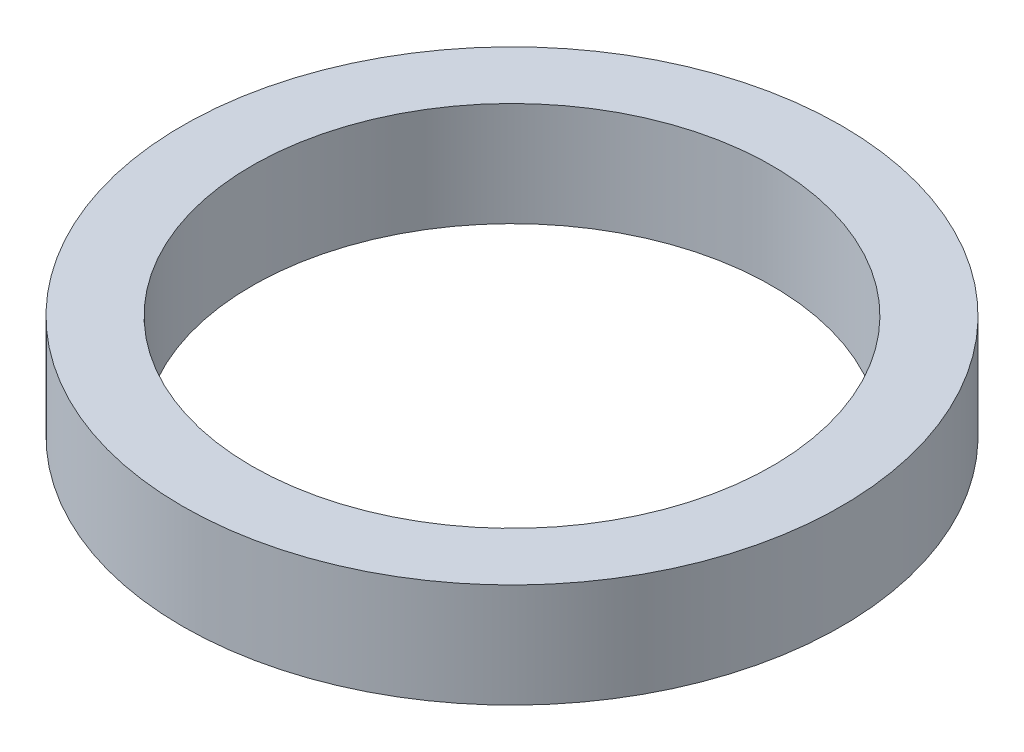
ISO-10303-21;
HEADER;
FILE_DESCRIPTION(('STEP AP214'),'2;1');
FILE_NAME('part.step','',(''),(''),'','','');
FILE_SCHEMA(('AUTOMOTIVE_DESIGN { 1 0 10303 214 1 1 1 1 }'));
ENDSEC;
DATA;
#1=APPLICATION_CONTEXT('core data for automotive mechanical design processes');
#2=APPLICATION_PROTOCOL_DEFINITION('international standard','automotive_design',2000,#1);
#3=PRODUCT_CONTEXT('',#1,'mechanical');
#4=PRODUCT('Part','Part','',(#3));
#5=PRODUCT_RELATED_PRODUCT_CATEGORY('part','',(#4));
#6=PRODUCT_DEFINITION_FORMATION('','',#4);
#7=PRODUCT_DEFINITION_CONTEXT('part definition',#1,'design');
#8=PRODUCT_DEFINITION('design','',#6,#7);
#9=PRODUCT_DEFINITION_SHAPE('','',#8);
#10=(LENGTH_UNIT() NAMED_UNIT(*) SI_UNIT(.MILLI.,.METRE.));
#11=(NAMED_UNIT(*) PLANE_ANGLE_UNIT() SI_UNIT($,.RADIAN.));
#12=(NAMED_UNIT(*) SI_UNIT($,.STERADIAN.) SOLID_ANGLE_UNIT());
#13=UNCERTAINTY_MEASURE_WITH_UNIT(LENGTH_MEASURE(1.E-05),#10,'distance_accuracy_value','');
#14=(GEOMETRIC_REPRESENTATION_CONTEXT(3) GLOBAL_UNCERTAINTY_ASSIGNED_CONTEXT((#13)) GLOBAL_UNIT_ASSIGNED_CONTEXT((#10,
#11,#12)) REPRESENTATION_CONTEXT('',''));
#15=CARTESIAN_POINT('',(0.,0.,0.));
#16=DIRECTION('',(0.,0.,1.));
#17=DIRECTION('',(1.,0.,0.));
#18=AXIS2_PLACEMENT_3D('',#15,#16,#17);
#19=CARTESIAN_POINT('',(0.,6.,0.));
#20=DIRECTION('',(0.,1.,0.));
#21=DIRECTION('',(0.,0.,1.));
#22=AXIS2_PLACEMENT_3D('',#19,#20,#21);
#23=PLANE('',#22);
#24=CARTESIAN_POINT('',(0.,6.,0.));
#25=DIRECTION('',(0.,1.,0.));
#26=DIRECTION('',(0.,0.,1.));
#27=AXIS2_PLACEMENT_3D('',#24,#25,#26);
#28=CIRCLE('',#27,19.);
#29=CARTESIAN_POINT('',(0.,6.,19.));
#30=VERTEX_POINT('',#29);
#31=EDGE_CURVE('E10',#30,#30,#28,.T.);
#32=ORIENTED_EDGE('',*,*,#31,.T.);
#33=EDGE_LOOP('',(#32));
#34=FACE_BOUND('',#33,.T.);
#35=CARTESIAN_POINT('',(0.,6.,0.));
#36=DIRECTION('',(0.,1.,0.));
#37=DIRECTION('',(0.,0.,1.));
#38=AXIS2_PLACEMENT_3D('',#35,#36,#37);
#39=CIRCLE('',#38,15.);
#40=CARTESIAN_POINT('',(0.,6.,15.));
#41=VERTEX_POINT('',#40);
#42=EDGE_CURVE('E43',#41,#41,#39,.T.);
#43=ORIENTED_EDGE('',*,*,#42,.F.);
#44=EDGE_LOOP('',(#43));
#45=FACE_BOUND('',#44,.T.);
#46=ADVANCED_FACE('F32',(#34,#45),#23,.T.);
#47=CARTESIAN_POINT('',(0.,0.,0.));
#48=DIRECTION('',(0.,1.,0.));
#49=DIRECTION('',(0.,0.,1.));
#50=AXIS2_PLACEMENT_3D('',#47,#48,#49);
#51=PLANE('',#50);
#52=CARTESIAN_POINT('',(0.,0.,0.));
#53=DIRECTION('',(0.,1.,0.));
#54=DIRECTION('',(0.,0.,1.));
#55=AXIS2_PLACEMENT_3D('',#52,#53,#54);
#56=CIRCLE('',#55,19.);
#57=CARTESIAN_POINT('',(0.,0.,19.));
#58=VERTEX_POINT('',#57);
#59=EDGE_CURVE('E36',#58,#58,#56,.T.);
#60=ORIENTED_EDGE('',*,*,#59,.F.);
#61=EDGE_LOOP('',(#60));
#62=FACE_BOUND('',#61,.T.);
#63=CARTESIAN_POINT('',(0.,0.,0.));
#64=DIRECTION('',(0.,1.,0.));
#65=DIRECTION('',(0.,0.,1.));
#66=AXIS2_PLACEMENT_3D('',#63,#64,#65);
#67=CIRCLE('',#66,15.);
#68=CARTESIAN_POINT('',(0.,0.,15.));
#69=VERTEX_POINT('',#68);
#70=EDGE_CURVE('E45',#69,#69,#67,.T.);
#71=ORIENTED_EDGE('',*,*,#70,.T.);
#72=EDGE_LOOP('',(#71));
#73=FACE_BOUND('',#72,.T.);
#74=ADVANCED_FACE('F55',(#62,#73),#51,.F.);
#75=CARTESIAN_POINT('',(0.,6.,0.));
#76=DIRECTION('',(0.,-1.,0.));
#77=DIRECTION('',(0.,0.,-1.));
#78=AXIS2_PLACEMENT_3D('',#75,#76,#77);
#79=CYLINDRICAL_SURFACE('',#78,19.);
#80=ORIENTED_EDGE('',*,*,#31,.F.);
#81=EDGE_LOOP('',(#80));
#82=FACE_BOUND('',#81,.T.);
#83=ORIENTED_EDGE('',*,*,#59,.T.);
#84=EDGE_LOOP('',(#83));
#85=FACE_BOUND('',#84,.T.);
#86=ADVANCED_FACE('F34',(#82,#85),#79,.T.);
#87=CARTESIAN_POINT('',(0.,6.,0.));
#88=DIRECTION('',(0.,-1.,0.));
#89=DIRECTION('',(0.,0.,-1.));
#90=AXIS2_PLACEMENT_3D('',#87,#88,#89);
#91=CYLINDRICAL_SURFACE('',#90,15.);
#92=ORIENTED_EDGE('',*,*,#42,.T.);
#93=EDGE_LOOP('',(#92));
#94=FACE_BOUND('',#93,.T.);
#95=ORIENTED_EDGE('',*,*,#70,.F.);
#96=EDGE_LOOP('',(#95));
#97=FACE_BOUND('',#96,.T.);
#98=ADVANCED_FACE('F51',(#94,#97),#91,.F.);
#99=CLOSED_SHELL('',(#46,#74,#86,#98));
#100=MANIFOLD_SOLID_BREP('B2',#99);
#101=ADVANCED_BREP_SHAPE_REPRESENTATION('',(#18,#100),#14);
#102=SHAPE_DEFINITION_REPRESENTATION(#9,#101);
ENDSEC;
END-ISO-10303-21;
